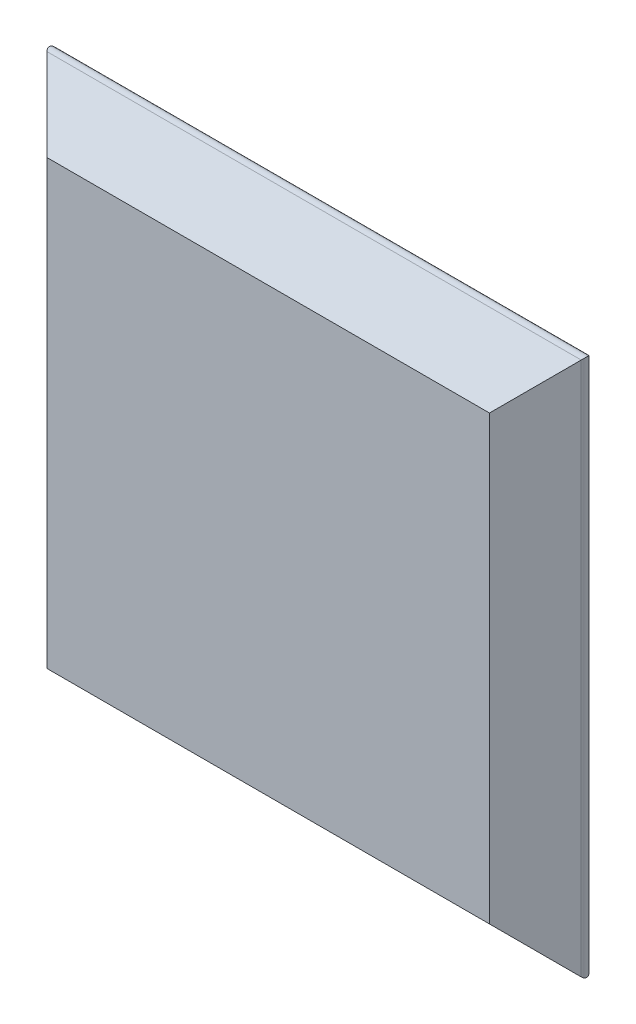
ISO-10303-21;
HEADER;
FILE_DESCRIPTION(('STEP AP214'),'2;1');
FILE_NAME('part.step','',(''),(''),'','','');
FILE_SCHEMA(('AUTOMOTIVE_DESIGN { 1 0 10303 214 1 1 1 1 }'));
ENDSEC;
DATA;
#1=APPLICATION_CONTEXT('core data for automotive mechanical design processes');
#2=APPLICATION_PROTOCOL_DEFINITION('international standard','automotive_design',2000,#1);
#3=PRODUCT_CONTEXT('',#1,'mechanical');
#4=PRODUCT('Part','Part','',(#3));
#5=PRODUCT_RELATED_PRODUCT_CATEGORY('part','',(#4));
#6=PRODUCT_DEFINITION_FORMATION('','',#4);
#7=PRODUCT_DEFINITION_CONTEXT('part definition',#1,'design');
#8=PRODUCT_DEFINITION('design','',#6,#7);
#9=PRODUCT_DEFINITION_SHAPE('','',#8);
#10=(LENGTH_UNIT() NAMED_UNIT(*) SI_UNIT(.MILLI.,.METRE.));
#11=(NAMED_UNIT(*) PLANE_ANGLE_UNIT() SI_UNIT($,.RADIAN.));
#12=(NAMED_UNIT(*) SI_UNIT($,.STERADIAN.) SOLID_ANGLE_UNIT());
#13=UNCERTAINTY_MEASURE_WITH_UNIT(LENGTH_MEASURE(1.E-05),#10,'distance_accuracy_value','');
#14=(GEOMETRIC_REPRESENTATION_CONTEXT(3) GLOBAL_UNCERTAINTY_ASSIGNED_CONTEXT((#13)) GLOBAL_UNIT_ASSIGNED_CONTEXT((#10,
#11,#12)) REPRESENTATION_CONTEXT('',''));
#15=CARTESIAN_POINT('',(0.,0.,0.));
#16=DIRECTION('',(0.,0.,1.));
#17=DIRECTION('',(1.,0.,0.));
#18=AXIS2_PLACEMENT_3D('',#15,#16,#17);
#19=CARTESIAN_POINT('',(50.,-50.,0.));
#20=DIRECTION('',(0.707106781186546,0.,0.707106781186549));
#21=DIRECTION('',(0.707106781186549,0.,-0.707106781186546));
#22=AXIS2_PLACEMENT_3D('',#19,#20,#21);
#23=PLANE('',#22);
#24=DIRECTION('',(0.577350269189627,-0.577350269189627,-0.577350269189624));
#25=VECTOR('',#24,1.);
#26=CARTESIAN_POINT('',(50.,-50.,0.));
#27=LINE('',#26,#25);
#28=CARTESIAN_POINT('',(40.,-40.,10.));
#29=VERTEX_POINT('',#28);
#30=CARTESIAN_POINT('',(48.2928932188135,-48.2928932188134,1.70710678118655));
#31=VERTEX_POINT('',#30);
#32=EDGE_CURVE('E120',#29,#31,#27,.T.);
#33=ORIENTED_EDGE('',*,*,#32,.T.);
#34=DIRECTION('',(0.,1.,0.));
#35=VECTOR('',#34,1.);
#36=CARTESIAN_POINT('',(48.2928932188135,50.,1.70710678118655));
#37=LINE('',#36,#35);
#38=CARTESIAN_POINT('',(48.2928932188135,48.2928932188135,1.70710678118654));
#39=VERTEX_POINT('',#38);
#40=EDGE_CURVE('E11',#31,#39,#37,.T.);
#41=ORIENTED_EDGE('',*,*,#40,.T.);
#42=DIRECTION('',(0.577350269189627,0.577350269189627,-0.577350269189624));
#43=VECTOR('',#42,1.);
#44=CARTESIAN_POINT('',(16.6666666666666,16.6666666666666,33.3333333333333));
#45=LINE('',#44,#43);
#46=CARTESIAN_POINT('',(40.,40.,10.));
#47=VERTEX_POINT('',#46);
#48=EDGE_CURVE('E98',#47,#39,#45,.T.);
#49=ORIENTED_EDGE('',*,*,#48,.F.);
#50=DIRECTION('',(0.,-1.,0.));
#51=VECTOR('',#50,1.);
#52=CARTESIAN_POINT('',(40.,0.,10.));
#53=LINE('',#52,#51);
#54=EDGE_CURVE('E104',#29,#47,#53,.F.);
#55=ORIENTED_EDGE('',*,*,#54,.F.);
#56=EDGE_LOOP('',(#33,#41,#49,#55));
#57=FACE_BOUND('',#56,.T.);
#58=ADVANCED_FACE('F37',(#57),#23,.T.);
#59=CARTESIAN_POINT('',(-50.,50.,0.));
#60=DIRECTION('',(0.,0.707106781186546,0.707106781186549));
#61=DIRECTION('',(0.,-0.707106781186549,0.707106781186546));
#62=AXIS2_PLACEMENT_3D('',#59,#60,#61);
#63=PLANE('',#62);
#64=ORIENTED_EDGE('',*,*,#48,.T.);
#65=DIRECTION('',(-1.,0.,0.));
#66=VECTOR('',#65,1.);
#67=CARTESIAN_POINT('',(-50.,48.2928932188134,1.70710678118655));
#68=LINE('',#67,#66);
#69=CARTESIAN_POINT('',(-48.2928932188134,48.2928932188135,1.70710678118655));
#70=VERTEX_POINT('',#69);
#71=EDGE_CURVE('E113',#39,#70,#68,.T.);
#72=ORIENTED_EDGE('',*,*,#71,.T.);
#73=DIRECTION('',(-0.577350269189627,0.577350269189627,-0.577350269189624));
#74=VECTOR('',#73,1.);
#75=CARTESIAN_POINT('',(-16.6666666666666,16.6666666666666,33.3333333333333));
#76=LINE('',#75,#74);
#77=CARTESIAN_POINT('',(-40.,40.,10.));
#78=VERTEX_POINT('',#77);
#79=EDGE_CURVE('E100',#78,#70,#76,.T.);
#80=ORIENTED_EDGE('',*,*,#79,.F.);
#81=DIRECTION('',(1.,0.,0.));
#82=VECTOR('',#81,1.);
#83=CARTESIAN_POINT('',(0.,40.,10.));
#84=LINE('',#83,#82);
#85=EDGE_CURVE('E93',#47,#78,#84,.F.);
#86=ORIENTED_EDGE('',*,*,#85,.F.);
#87=EDGE_LOOP('',(#64,#72,#80,#86));
#88=FACE_BOUND('',#87,.T.);
#89=ADVANCED_FACE('F95',(#88),#63,.T.);
#90=CARTESIAN_POINT('',(-50.,-50.,0.));
#91=DIRECTION('',(-0.707106781186546,0.,0.707106781186549));
#92=DIRECTION('',(0.707106781186549,0.,0.707106781186546));
#93=AXIS2_PLACEMENT_3D('',#90,#91,#92);
#94=PLANE('',#93);
#95=ORIENTED_EDGE('',*,*,#79,.T.);
#96=DIRECTION('',(0.,-1.,0.));
#97=VECTOR('',#96,1.);
#98=CARTESIAN_POINT('',(-48.2928932188134,-50.,1.70710678118655));
#99=LINE('',#98,#97);
#100=CARTESIAN_POINT('',(-48.2928932188134,-48.2928932188134,1.70710678118655));
#101=VERTEX_POINT('',#100);
#102=EDGE_CURVE('E61',#70,#101,#99,.T.);
#103=ORIENTED_EDGE('',*,*,#102,.T.);
#104=DIRECTION('',(-0.577350269189627,-0.577350269189627,-0.577350269189624));
#105=VECTOR('',#104,1.);
#106=CARTESIAN_POINT('',(-50.,-50.,0.));
#107=LINE('',#106,#105);
#108=CARTESIAN_POINT('',(-40.,-40.,10.));
#109=VERTEX_POINT('',#108);
#110=EDGE_CURVE('E117',#109,#101,#107,.T.);
#111=ORIENTED_EDGE('',*,*,#110,.F.);
#112=DIRECTION('',(0.,1.,0.));
#113=VECTOR('',#112,1.);
#114=CARTESIAN_POINT('',(-40.,0.,10.));
#115=LINE('',#114,#113);
#116=EDGE_CURVE('E103',#78,#109,#115,.F.);
#117=ORIENTED_EDGE('',*,*,#116,.F.);
#118=EDGE_LOOP('',(#95,#103,#111,#117));
#119=FACE_BOUND('',#118,.T.);
#120=ADVANCED_FACE('F158',(#119),#94,.T.);
#121=CARTESIAN_POINT('',(-50.,-50.,0.));
#122=DIRECTION('',(0.,-0.707106781186546,0.707106781186549));
#123=DIRECTION('',(0.,-0.707106781186549,-0.707106781186546));
#124=AXIS2_PLACEMENT_3D('',#121,#122,#123);
#125=PLANE('',#124);
#126=ORIENTED_EDGE('',*,*,#110,.T.);
#127=DIRECTION('',(1.,0.,0.));
#128=VECTOR('',#127,1.);
#129=CARTESIAN_POINT('',(50.,-48.2928932188134,1.70710678118655));
#130=LINE('',#129,#128);
#131=EDGE_CURVE('E46',#101,#31,#130,.T.);
#132=ORIENTED_EDGE('',*,*,#131,.T.);
#133=ORIENTED_EDGE('',*,*,#32,.F.);
#134=DIRECTION('',(-1.,0.,0.));
#135=VECTOR('',#134,1.);
#136=CARTESIAN_POINT('',(0.,-40.,10.));
#137=LINE('',#136,#135);
#138=EDGE_CURVE('E109',#109,#29,#137,.F.);
#139=ORIENTED_EDGE('',*,*,#138,.F.);
#140=EDGE_LOOP('',(#126,#132,#133,#139));
#141=FACE_BOUND('',#140,.T.);
#142=ADVANCED_FACE('F159',(#141),#125,.T.);
#143=CARTESIAN_POINT('',(0.,0.,10.));
#144=DIRECTION('',(0.,0.,-1.));
#145=DIRECTION('',(-1.,0.,0.));
#146=AXIS2_PLACEMENT_3D('',#143,#144,#145);
#147=PLANE('',#146);
#148=ORIENTED_EDGE('',*,*,#54,.T.);
#149=ORIENTED_EDGE('',*,*,#85,.T.);
#150=ORIENTED_EDGE('',*,*,#116,.T.);
#151=ORIENTED_EDGE('',*,*,#138,.T.);
#152=EDGE_LOOP('',(#148,#149,#150,#151));
#153=FACE_BOUND('',#152,.T.);
#154=ADVANCED_FACE('F107',(#153),#147,.F.);
#155=CARTESIAN_POINT('',(0.,0.,0.));
#156=DIRECTION('',(0.,0.,-1.));
#157=DIRECTION('',(-1.,0.,0.));
#158=AXIS2_PLACEMENT_3D('',#155,#156,#157);
#159=PLANE('',#158);
#160=DIRECTION('',(0.,1.,0.));
#161=VECTOR('',#160,1.);
#162=CARTESIAN_POINT('',(-47.5857864376269,50.,0.));
#163=LINE('',#162,#161);
#164=CARTESIAN_POINT('',(-47.5857864376269,-47.5857864376269,0.));
#165=VERTEX_POINT('',#164);
#166=CARTESIAN_POINT('',(-47.5857864376269,47.5857864376269,0.));
#167=VERTEX_POINT('',#166);
#168=EDGE_CURVE('E128',#165,#167,#163,.T.);
#169=ORIENTED_EDGE('',*,*,#168,.T.);
#170=DIRECTION('',(1.,0.,0.));
#171=VECTOR('',#170,1.);
#172=CARTESIAN_POINT('',(50.,47.5857864376269,0.));
#173=LINE('',#172,#171);
#174=CARTESIAN_POINT('',(47.5857864376269,47.5857864376269,0.));
#175=VERTEX_POINT('',#174);
#176=EDGE_CURVE('E130',#167,#175,#173,.T.);
#177=ORIENTED_EDGE('',*,*,#176,.T.);
#178=DIRECTION('',(0.,-1.,0.));
#179=VECTOR('',#178,1.);
#180=CARTESIAN_POINT('',(47.5857864376269,-50.,0.));
#181=LINE('',#180,#179);
#182=CARTESIAN_POINT('',(47.5857864376269,-47.5857864376269,0.));
#183=VERTEX_POINT('',#182);
#184=EDGE_CURVE('E115',#175,#183,#181,.T.);
#185=ORIENTED_EDGE('',*,*,#184,.T.);
#186=DIRECTION('',(-1.,0.,0.));
#187=VECTOR('',#186,1.);
#188=CARTESIAN_POINT('',(-50.,-47.5857864376269,0.));
#189=LINE('',#188,#187);
#190=EDGE_CURVE('E126',#183,#165,#189,.T.);
#191=ORIENTED_EDGE('',*,*,#190,.T.);
#192=EDGE_LOOP('',(#169,#177,#185,#191));
#193=FACE_BOUND('',#192,.T.);
#194=ADVANCED_FACE('F151',(#193),#159,.T.);
#195=CARTESIAN_POINT('',(-50.,-47.5857864376269,1.));
#196=DIRECTION('',(1.,0.,0.));
#197=DIRECTION('',(0.,0.,-1.));
#198=AXIS2_PLACEMENT_3D('',#195,#196,#197);
#199=CYLINDRICAL_SURFACE('',#198,1.);
#200=CARTESIAN_POINT('',(-47.5857864376269,-47.5857864376269,1.));
#201=DIRECTION('',(0.707106781186547,-0.707106781186547,0.));
#202=DIRECTION('',(0.707106781186547,0.707106781186547,0.));
#203=AXIS2_PLACEMENT_3D('',#200,#201,#202);
#204=ELLIPSE('',#203,1.41421356237309,1.);
#205=EDGE_CURVE('E138',#165,#101,#204,.F.);
#206=ORIENTED_EDGE('',*,*,#205,.F.);
#207=ORIENTED_EDGE('',*,*,#190,.F.);
#208=CARTESIAN_POINT('',(47.5857864376269,-47.5857864376269,1.));
#209=DIRECTION('',(0.707106781186547,0.707106781186547,0.));
#210=DIRECTION('',(-0.707106781186547,0.707106781186547,0.));
#211=AXIS2_PLACEMENT_3D('',#208,#209,#210);
#212=ELLIPSE('',#211,1.41421356237309,1.);
#213=EDGE_CURVE('E41',#31,#183,#212,.T.);
#214=ORIENTED_EDGE('',*,*,#213,.F.);
#215=ORIENTED_EDGE('',*,*,#131,.F.);
#216=EDGE_LOOP('',(#206,#207,#214,#215));
#217=FACE_BOUND('',#216,.T.);
#218=ADVANCED_FACE('F39',(#217),#199,.T.);
#219=CARTESIAN_POINT('',(47.5857864376269,-50.,1.));
#220=DIRECTION('',(0.,1.,0.));
#221=DIRECTION('',(0.,0.,1.));
#222=AXIS2_PLACEMENT_3D('',#219,#220,#221);
#223=CYLINDRICAL_SURFACE('',#222,1.);
#224=ORIENTED_EDGE('',*,*,#213,.T.);
#225=ORIENTED_EDGE('',*,*,#184,.F.);
#226=CARTESIAN_POINT('',(47.5857864376269,47.5857864376269,1.));
#227=DIRECTION('',(-0.707106781186547,0.707106781186547,0.));
#228=DIRECTION('',(0.707106781186547,0.707106781186547,0.));
#229=AXIS2_PLACEMENT_3D('',#226,#227,#228);
#230=ELLIPSE('',#229,1.41421356237309,1.);
#231=EDGE_CURVE('E137',#39,#175,#230,.T.);
#232=ORIENTED_EDGE('',*,*,#231,.F.);
#233=ORIENTED_EDGE('',*,*,#40,.F.);
#234=EDGE_LOOP('',(#224,#225,#232,#233));
#235=FACE_BOUND('',#234,.T.);
#236=ADVANCED_FACE('F147',(#235),#223,.T.);
#237=CARTESIAN_POINT('',(-47.5857864376269,-50.,1.));
#238=DIRECTION('',(0.,-1.,0.));
#239=DIRECTION('',(0.,0.,-1.));
#240=AXIS2_PLACEMENT_3D('',#237,#238,#239);
#241=CYLINDRICAL_SURFACE('',#240,1.);
#242=ORIENTED_EDGE('',*,*,#205,.T.);
#243=ORIENTED_EDGE('',*,*,#102,.F.);
#244=CARTESIAN_POINT('',(-47.5857864376269,47.5857864376269,1.));
#245=DIRECTION('',(-0.707106781186547,-0.707106781186547,0.));
#246=DIRECTION('',(0.707106781186547,-0.707106781186547,0.));
#247=AXIS2_PLACEMENT_3D('',#244,#245,#246);
#248=ELLIPSE('',#247,1.41421356237309,1.);
#249=EDGE_CURVE('E135',#167,#70,#248,.F.);
#250=ORIENTED_EDGE('',*,*,#249,.F.);
#251=ORIENTED_EDGE('',*,*,#168,.F.);
#252=EDGE_LOOP('',(#242,#243,#250,#251));
#253=FACE_BOUND('',#252,.T.);
#254=ADVANCED_FACE('F157',(#253),#241,.T.);
#255=CARTESIAN_POINT('',(-50.,47.5857864376269,1.));
#256=DIRECTION('',(-1.,0.,0.));
#257=DIRECTION('',(0.,0.,1.));
#258=AXIS2_PLACEMENT_3D('',#255,#256,#257);
#259=CYLINDRICAL_SURFACE('',#258,1.);
#260=ORIENTED_EDGE('',*,*,#231,.T.);
#261=ORIENTED_EDGE('',*,*,#176,.F.);
#262=ORIENTED_EDGE('',*,*,#249,.T.);
#263=ORIENTED_EDGE('',*,*,#71,.F.);
#264=EDGE_LOOP('',(#260,#261,#262,#263));
#265=FACE_BOUND('',#264,.T.);
#266=ADVANCED_FACE('F155',(#265),#259,.T.);
#267=CLOSED_SHELL('',(#58,#89,#120,#142,#154,#194,#218,#236,#254,#266));
#268=MANIFOLD_SOLID_BREP('B2',#267);
#269=ADVANCED_BREP_SHAPE_REPRESENTATION('',(#18,#268),#14);
#270=SHAPE_DEFINITION_REPRESENTATION(#9,#269);
ENDSEC;
END-ISO-10303-21;
